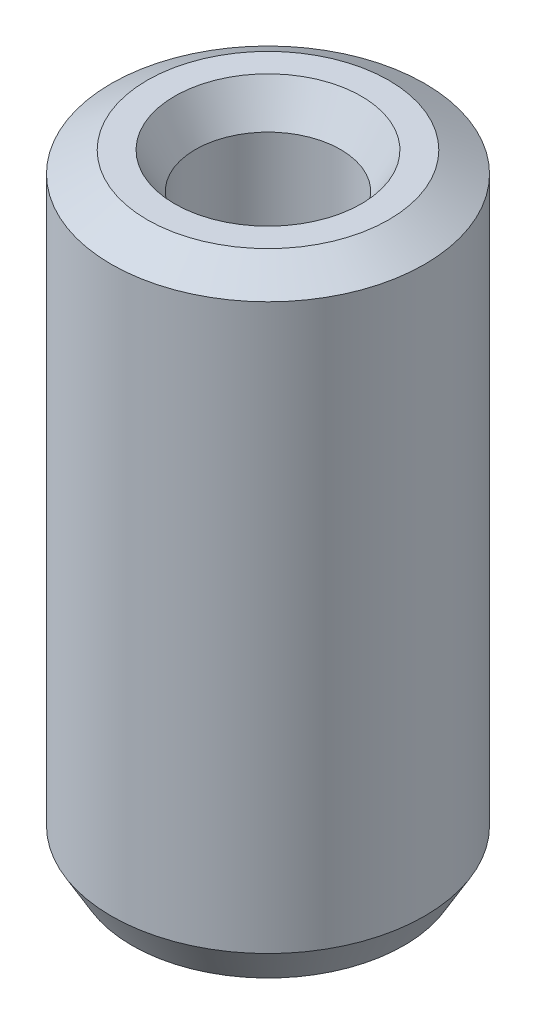
ISO-10303-21;
HEADER;
FILE_DESCRIPTION(('STEP AP214'),'2;1');
FILE_NAME('part.step','',(''),(''),'','','');
FILE_SCHEMA(('AUTOMOTIVE_DESIGN { 1 0 10303 214 1 1 1 1 }'));
ENDSEC;
DATA;
#1=APPLICATION_CONTEXT('core data for automotive mechanical design processes');
#2=APPLICATION_PROTOCOL_DEFINITION('international standard','automotive_design',2000,#1);
#3=PRODUCT_CONTEXT('',#1,'mechanical');
#4=PRODUCT('Part','Part','',(#3));
#5=PRODUCT_RELATED_PRODUCT_CATEGORY('part','',(#4));
#6=PRODUCT_DEFINITION_FORMATION('','',#4);
#7=PRODUCT_DEFINITION_CONTEXT('part definition',#1,'design');
#8=PRODUCT_DEFINITION('design','',#6,#7);
#9=PRODUCT_DEFINITION_SHAPE('','',#8);
#10=(LENGTH_UNIT() NAMED_UNIT(*) SI_UNIT(.MILLI.,.METRE.));
#11=(NAMED_UNIT(*) PLANE_ANGLE_UNIT() SI_UNIT($,.RADIAN.));
#12=(NAMED_UNIT(*) SI_UNIT($,.STERADIAN.) SOLID_ANGLE_UNIT());
#13=UNCERTAINTY_MEASURE_WITH_UNIT(LENGTH_MEASURE(1.E-05),#10,'distance_accuracy_value','');
#14=(GEOMETRIC_REPRESENTATION_CONTEXT(3) GLOBAL_UNCERTAINTY_ASSIGNED_CONTEXT((#13)) GLOBAL_UNIT_ASSIGNED_CONTEXT((#10,
#11,#12)) REPRESENTATION_CONTEXT('',''));
#15=CARTESIAN_POINT('',(0.,0.,0.));
#16=DIRECTION('',(0.,0.,1.));
#17=DIRECTION('',(1.,0.,0.));
#18=AXIS2_PLACEMENT_3D('',#15,#16,#17);
#19=CARTESIAN_POINT('',(0.,89.1913426871071,0.));
#20=DIRECTION('',(0.,-1.,0.));
#21=DIRECTION('',(0.,0.,-1.));
#22=AXIS2_PLACEMENT_3D('',#19,#20,#21);
#23=CYLINDRICAL_SURFACE('',#22,22.5);
#24=CARTESIAN_POINT('',(0.,5.14901907962285,0.));
#25=DIRECTION('',(0.,1.,0.));
#26=DIRECTION('',(0.,0.,1.));
#27=AXIS2_PLACEMENT_3D('',#24,#25,#26);
#28=CIRCLE('',#27,22.5);
#29=CARTESIAN_POINT('',(0.,5.14901907962285,-22.5));
#30=VERTEX_POINT('',#29);
#31=EDGE_CURVE('E10',#30,#30,#28,.T.);
#32=CARTESIAN_POINT('',(0.,86.2185551354244,0.));
#33=DIRECTION('',(0.,1.,0.));
#34=DIRECTION('',(0.,0.,1.));
#35=AXIS2_PLACEMENT_3D('',#32,#33,#34);
#36=CIRCLE('',#35,22.5);
#37=CARTESIAN_POINT('',(0.,86.2185551354244,-22.5));
#38=VERTEX_POINT('',#37);
#39=EDGE_CURVE('E50',#38,#38,#36,.F.);
#40=CARTESIAN_POINT('',(0.,5.14901907962285,-22.5));
#41=CARTESIAN_POINT('',(0.,5.99349341353745,-22.5));
#42=CARTESIAN_POINT('',(0.,6.83796774745205,-22.5));
#43=CARTESIAN_POINT('',(0.,8.52691641528125,-22.5));
#44=CARTESIAN_POINT('',(0.,9.37139074919585,-22.5));
#45=CARTESIAN_POINT('',(0.,11.060339417025,-22.5));
#46=CARTESIAN_POINT('',(0.,11.9048137509396,-22.5));
#47=CARTESIAN_POINT('',(0.,13.5937624187688,-22.5));
#48=CARTESIAN_POINT('',(0.,14.4382367526834,-22.5));
#49=CARTESIAN_POINT('',(0.,16.1271854205126,-22.5));
#50=CARTESIAN_POINT('',(0.,16.9716597544272,-22.5));
#51=CARTESIAN_POINT('',(0.,18.6606084222564,-22.5));
#52=CARTESIAN_POINT('',(0.,19.505082756171,-22.5));
#53=CARTESIAN_POINT('',(0.,21.1940314240002,-22.5));
#54=CARTESIAN_POINT('',(0.,22.0385057579148,-22.5));
#55=CARTESIAN_POINT('',(0.,23.727454425744,-22.5));
#56=CARTESIAN_POINT('',(0.,24.5719287596586,-22.5));
#57=CARTESIAN_POINT('',(0.,26.2608774274878,-22.5));
#58=CARTESIAN_POINT('',(0.,27.1053517614024,-22.5));
#59=CARTESIAN_POINT('',(0.,28.7943004292316,-22.5));
#60=CARTESIAN_POINT('',(0.,29.6387747631462,-22.5));
#61=CARTESIAN_POINT('',(0.,31.3277234309754,-22.5));
#62=CARTESIAN_POINT('',(0.,32.17219776489,-22.5));
#63=CARTESIAN_POINT('',(0.,33.8611464327192,-22.5));
#64=CARTESIAN_POINT('',(0.,34.7056207666338,-22.5));
#65=CARTESIAN_POINT('',(0.,36.394569434463,-22.5));
#66=CARTESIAN_POINT('',(0.,37.2390437683776,-22.5));
#67=CARTESIAN_POINT('',(0.,38.9279924362068,-22.5));
#68=CARTESIAN_POINT('',(0.,39.7724667701214,-22.5));
#69=CARTESIAN_POINT('',(0.,41.4614154379506,-22.5));
#70=CARTESIAN_POINT('',(0.,42.3058897718652,-22.5));
#71=CARTESIAN_POINT('',(0.,43.9948384396944,-22.5));
#72=CARTESIAN_POINT('',(0.,44.839312773609,-22.5));
#73=CARTESIAN_POINT('',(0.,46.5282614414382,-22.5));
#74=CARTESIAN_POINT('',(0.,47.3727357753528,-22.5));
#75=CARTESIAN_POINT('',(0.,49.061684443182,-22.5));
#76=CARTESIAN_POINT('',(0.,49.9061587770966,-22.5));
#77=CARTESIAN_POINT('',(0.,51.5951074449258,-22.5));
#78=CARTESIAN_POINT('',(0.,52.4395817788404,-22.5));
#79=CARTESIAN_POINT('',(0.,54.1285304466696,-22.5));
#80=CARTESIAN_POINT('',(0.,54.9730047805842,-22.5));
#81=CARTESIAN_POINT('',(0.,56.6619534484134,-22.5));
#82=CARTESIAN_POINT('',(0.,57.506427782328,-22.5));
#83=CARTESIAN_POINT('',(0.,59.1953764501572,-22.5));
#84=CARTESIAN_POINT('',(0.,60.0398507840718,-22.5));
#85=CARTESIAN_POINT('',(0.,61.728799451901,-22.5));
#86=CARTESIAN_POINT('',(0.,62.5732737858156,-22.5));
#87=CARTESIAN_POINT('',(0.,64.2622224536448,-22.5));
#88=CARTESIAN_POINT('',(0.,65.1066967875594,-22.5));
#89=CARTESIAN_POINT('',(0.,66.7956454553886,-22.5));
#90=CARTESIAN_POINT('',(0.,67.6401197893032,-22.5));
#91=CARTESIAN_POINT('',(0.,69.3290684571324,-22.5));
#92=CARTESIAN_POINT('',(0.,70.173542791047,-22.5));
#93=CARTESIAN_POINT('',(0.,71.8624914588762,-22.5));
#94=CARTESIAN_POINT('',(0.,72.7069657927908,-22.5));
#95=CARTESIAN_POINT('',(0.,74.39591446062,-22.5));
#96=CARTESIAN_POINT('',(0.,75.2403887945346,-22.5));
#97=CARTESIAN_POINT('',(0.,76.9293374623638,-22.5));
#98=CARTESIAN_POINT('',(0.,77.7738117962784,-22.5));
#99=CARTESIAN_POINT('',(0.,79.4627604641076,-22.5));
#100=CARTESIAN_POINT('',(0.,80.3072347980222,-22.5));
#101=CARTESIAN_POINT('',(0.,81.9961834658514,-22.5));
#102=CARTESIAN_POINT('',(0.,82.840657799766,-22.5));
#103=CARTESIAN_POINT('',(0.,84.5296064675952,-22.5));
#104=CARTESIAN_POINT('',(0.,85.3740808015098,-22.5));
#105=CARTESIAN_POINT('',(0.,86.2185551354244,-22.5));
#106=B_SPLINE_CURVE_WITH_KNOTS('',3,(#40,#41,#42,#43,#44,#45,#46,#47,#48,#49,#50,#51,#52,#53,
#54,#55,#56,#57,#58,#59,#60,#61,#62,#63,#64,#65,#66,#67,#68,#69,#70,#71,#72,#73,#74,#75,#76,#77,
#78,#79,#80,#81,#82,#83,#84,#85,#86,#87,#88,#89,#90,#91,#92,#93,#94,#95,#96,#97,#98,#99,#100,
#101,#102,#103,#104,#105),.UNSPECIFIED.,.F.,.F.,(4,2,2,2,2,2,2,2,2,2,2,2,2,2,2,2,2,2,2,2,2,2,2,
2,2,2,2,2,2,2,2,2,4),(0.,2.53342300174379,5.0668460034876,7.60026900523139,10.1336920069752,
12.667115008719,15.2005380104628,17.7339610122066,20.2673840139504,22.8008070156942,
25.334230017438,27.8676530191818,30.4010760209256,32.9344990226694,35.4679220244132,
38.0013450261569,40.5347680279008,43.0681910296446,45.6016140313883,48.1350370331321,
50.6684600348759,53.2018830366197,55.7353060383635,58.2687290401073,60.8021520418511,
63.3355750435949,65.8689980453387,68.4024210470825,70.9358440488263,73.4692670505701,
76.0026900523139,78.5361130540577,81.0695360558015),.UNSPECIFIED.);
#107=EDGE_CURVE('BSEAM39',#30,#38,#106,.T.);
#108=ORIENTED_EDGE('',*,*,#31,.T.);
#109=ORIENTED_EDGE('',*,*,#39,.T.);
#110=ORIENTED_EDGE('',*,*,#107,.T.);
#111=ORIENTED_EDGE('',*,*,#107,.F.);
#112=EDGE_LOOP('',(#108,#110,#109,#111));
#113=FACE_BOUND('',#112,.T.);
#114=ADVANCED_FACE('F39',(#113),#23,.T.);
#115=CARTESIAN_POINT('',(0.,89.1913426871071,0.));
#116=DIRECTION('',(0.,1.,0.));
#117=DIRECTION('',(0.,0.,1.));
#118=AXIS2_PLACEMENT_3D('',#115,#116,#117);
#119=PLANE('',#118);
#120=CARTESIAN_POINT('',(0.,89.1913426871071,0.));
#121=DIRECTION('',(0.,1.,0.));
#122=DIRECTION('',(0.,0.,1.));
#123=AXIS2_PLACEMENT_3D('',#120,#121,#122);
#124=CIRCLE('',#123,13.4046888107313);
#125=CARTESIAN_POINT('',(0.,89.1913426871071,13.4046888107313));
#126=VERTEX_POINT('',#125);
#127=EDGE_CURVE('E58',#126,#126,#124,.F.);
#128=ORIENTED_EDGE('',*,*,#127,.T.);
#129=EDGE_LOOP('',(#128));
#130=FACE_BOUND('',#129,.T.);
#131=CARTESIAN_POINT('',(0.,89.1913426871071,0.));
#132=DIRECTION('',(0.,1.,0.));
#133=DIRECTION('',(0.,0.,1.));
#134=AXIS2_PLACEMENT_3D('',#131,#132,#133);
#135=CIRCLE('',#134,17.3509809203773);
#136=CARTESIAN_POINT('',(0.,89.1913426871071,17.3509809203773));
#137=VERTEX_POINT('',#136);
#138=EDGE_CURVE('E61',#137,#137,#135,.T.);
#139=ORIENTED_EDGE('',*,*,#138,.T.);
#140=EDGE_LOOP('',(#139));
#141=FACE_BOUND('',#140,.T.);
#142=ADVANCED_FACE('F88',(#130,#141),#119,.T.);
#143=CARTESIAN_POINT('',(0.,0.,0.));
#144=DIRECTION('',(0.,1.,0.));
#145=DIRECTION('',(0.,0.,1.));
#146=AXIS2_PLACEMENT_3D('',#143,#144,#145);
#147=PLANE('',#146);
#148=CARTESIAN_POINT('',(0.,0.,0.));
#149=DIRECTION('',(0.,1.,0.));
#150=DIRECTION('',(0.,0.,1.));
#151=AXIS2_PLACEMENT_3D('',#148,#149,#150);
#152=CIRCLE('',#151,15.5809203386711);
#153=CARTESIAN_POINT('',(0.,0.,15.5809203386711));
#154=VERTEX_POINT('',#153);
#155=EDGE_CURVE('E51',#154,#154,#152,.T.);
#156=ORIENTED_EDGE('',*,*,#155,.T.);
#157=EDGE_LOOP('',(#156));
#158=FACE_BOUND('',#157,.T.);
#159=CARTESIAN_POINT('',(0.,0.,0.));
#160=DIRECTION('',(0.,1.,0.));
#161=DIRECTION('',(0.,0.,1.));
#162=AXIS2_PLACEMENT_3D('',#159,#160,#161);
#163=CIRCLE('',#162,19.5272124483172);
#164=CARTESIAN_POINT('',(0.,0.,19.5272124483172));
#165=VERTEX_POINT('',#164);
#166=EDGE_CURVE('E54',#165,#165,#163,.F.);
#167=ORIENTED_EDGE('',*,*,#166,.T.);
#168=EDGE_LOOP('',(#167));
#169=FACE_BOUND('',#168,.T.);
#170=ADVANCED_FACE('F83',(#158,#169),#147,.F.);
#171=CARTESIAN_POINT('',(0.,89.1913426871071,0.));
#172=DIRECTION('',(0.,-1.,0.));
#173=DIRECTION('',(0.,0.,-1.));
#174=AXIS2_PLACEMENT_3D('',#171,#172,#173);
#175=CYLINDRICAL_SURFACE('',#174,10.4319012590484);
#176=CARTESIAN_POINT('',(0.,84.0423236074842,0.));
#177=DIRECTION('',(0.,1.,0.));
#178=DIRECTION('',(0.,0.,1.));
#179=AXIS2_PLACEMENT_3D('',#176,#177,#178);
#180=CIRCLE('',#179,10.4319012590484);
#181=CARTESIAN_POINT('',(0.,84.0423236074842,-10.4319012590484));
#182=VERTEX_POINT('',#181);
#183=EDGE_CURVE('E67',#182,#182,#180,.T.);
#184=CARTESIAN_POINT('',(0.,2.97278755168272,0.));
#185=DIRECTION('',(0.,1.,0.));
#186=DIRECTION('',(0.,0.,1.));
#187=AXIS2_PLACEMENT_3D('',#184,#185,#186);
#188=CIRCLE('',#187,10.4319012590484);
#189=CARTESIAN_POINT('',(0.,2.97278755168272,-10.4319012590484));
#190=VERTEX_POINT('',#189);
#191=EDGE_CURVE('E69',#190,#190,#188,.F.);
#192=CARTESIAN_POINT('',(0.,84.0423236074842,-10.4319012590484));
#193=CARTESIAN_POINT('',(0.,83.1978492735696,-10.4319012590484));
#194=CARTESIAN_POINT('',(0.,82.353374939655,-10.4319012590484));
#195=CARTESIAN_POINT('',(0.,80.6644262718258,-10.4319012590484));
#196=CARTESIAN_POINT('',(0.,79.8199519379112,-10.4319012590484));
#197=CARTESIAN_POINT('',(0.,78.131003270082,-10.4319012590484));
#198=CARTESIAN_POINT('',(0.,77.2865289361674,-10.4319012590484));
#199=CARTESIAN_POINT('',(0.,75.5975802683382,-10.4319012590484));
#200=CARTESIAN_POINT('',(0.,74.7531059344236,-10.4319012590484));
#201=CARTESIAN_POINT('',(0.,73.0641572665944,-10.4319012590484));
#202=CARTESIAN_POINT('',(0.,72.2196829326798,-10.4319012590484));
#203=CARTESIAN_POINT('',(0.,70.5307342648506,-10.4319012590484));
#204=CARTESIAN_POINT('',(0.,69.686259930936,-10.4319012590484));
#205=CARTESIAN_POINT('',(0.,67.9973112631068,-10.4319012590484));
#206=CARTESIAN_POINT('',(0.,67.1528369291922,-10.4319012590484));
#207=CARTESIAN_POINT('',(0.,65.463888261363,-10.4319012590484));
#208=CARTESIAN_POINT('',(0.,64.6194139274484,-10.4319012590484));
#209=CARTESIAN_POINT('',(0.,62.9304652596192,-10.4319012590484));
#210=CARTESIAN_POINT('',(0.,62.0859909257046,-10.4319012590484));
#211=CARTESIAN_POINT('',(0.,60.3970422578754,-10.4319012590484));
#212=CARTESIAN_POINT('',(0.,59.5525679239608,-10.4319012590484));
#213=CARTESIAN_POINT('',(0.,57.8636192561316,-10.4319012590484));
#214=CARTESIAN_POINT('',(0.,57.0191449222171,-10.4319012590484));
#215=CARTESIAN_POINT('',(0.,55.3301962543879,-10.4319012590484));
#216=CARTESIAN_POINT('',(0.,54.4857219204733,-10.4319012590484));
#217=CARTESIAN_POINT('',(0.,52.7967732526441,-10.4319012590484));
#218=CARTESIAN_POINT('',(0.,51.9522989187295,-10.4319012590484));
#219=CARTESIAN_POINT('',(0.,50.2633502509003,-10.4319012590484));
#220=CARTESIAN_POINT('',(0.,49.4188759169857,-10.4319012590484));
#221=CARTESIAN_POINT('',(0.,47.7299272491565,-10.4319012590484));
#222=CARTESIAN_POINT('',(0.,46.8854529152419,-10.4319012590484));
#223=CARTESIAN_POINT('',(0.,45.1965042474127,-10.4319012590484));
#224=CARTESIAN_POINT('',(0.,44.3520299134981,-10.4319012590484));
#225=CARTESIAN_POINT('',(0.,42.6630812456689,-10.4319012590484));
#226=CARTESIAN_POINT('',(0.,41.8186069117543,-10.4319012590484));
#227=CARTESIAN_POINT('',(0.,40.1296582439251,-10.4319012590484));
#228=CARTESIAN_POINT('',(0.,39.2851839100105,-10.4319012590484));
#229=CARTESIAN_POINT('',(0.,37.5962352421813,-10.4319012590484));
#230=CARTESIAN_POINT('',(0.,36.7517609082667,-10.4319012590484));
#231=CARTESIAN_POINT('',(0.,35.0628122404375,-10.4319012590484));
#232=CARTESIAN_POINT('',(0.,34.2183379065229,-10.4319012590484));
#233=CARTESIAN_POINT('',(0.,32.5293892386937,-10.4319012590484));
#234=CARTESIAN_POINT('',(0.,31.6849149047791,-10.4319012590484));
#235=CARTESIAN_POINT('',(0.,29.9959662369499,-10.4319012590484));
#236=CARTESIAN_POINT('',(0.,29.1514919030353,-10.4319012590484));
#237=CARTESIAN_POINT('',(0.,27.4625432352061,-10.4319012590484));
#238=CARTESIAN_POINT('',(0.,26.6180689012915,-10.4319012590484));
#239=CARTESIAN_POINT('',(0.,24.9291202334623,-10.4319012590484));
#240=CARTESIAN_POINT('',(0.,24.0846458995477,-10.4319012590484));
#241=CARTESIAN_POINT('',(0.,22.3956972317185,-10.4319012590484));
#242=CARTESIAN_POINT('',(0.,21.5512228978039,-10.4319012590484));
#243=CARTESIAN_POINT('',(0.,19.8622742299747,-10.4319012590484));
#244=CARTESIAN_POINT('',(0.,19.0177998960601,-10.4319012590484));
#245=CARTESIAN_POINT('',(0.,17.3288512282309,-10.4319012590484));
#246=CARTESIAN_POINT('',(0.,16.4843768943163,-10.4319012590484));
#247=CARTESIAN_POINT('',(0.,14.7954282264871,-10.4319012590484));
#248=CARTESIAN_POINT('',(0.,13.9509538925725,-10.4319012590484));
#249=CARTESIAN_POINT('',(0.,12.2620052247433,-10.4319012590484));
#250=CARTESIAN_POINT('',(0.,11.4175308908287,-10.4319012590484));
#251=CARTESIAN_POINT('',(0.,9.72858222299952,-10.4319012590484));
#252=CARTESIAN_POINT('',(0.,8.88410788908492,-10.4319012590484));
#253=CARTESIAN_POINT('',(0.,7.19515922125573,-10.4319012590484));
#254=CARTESIAN_POINT('',(0.,6.35068488734113,-10.4319012590484));
#255=CARTESIAN_POINT('',(0.,4.66173621951192,-10.4319012590484));
#256=CARTESIAN_POINT('',(0.,3.81726188559732,-10.4319012590484));
#257=CARTESIAN_POINT('',(0.,2.97278755168272,-10.4319012590484));
#258=B_SPLINE_CURVE_WITH_KNOTS('',3,(#192,#193,#194,#195,#196,#197,#198,#199,#200,#201,#202,
#203,#204,#205,#206,#207,#208,#209,#210,#211,#212,#213,#214,#215,#216,#217,#218,#219,#220,#221,
#222,#223,#224,#225,#226,#227,#228,#229,#230,#231,#232,#233,#234,#235,#236,#237,#238,#239,#240,
#241,#242,#243,#244,#245,#246,#247,#248,#249,#250,#251,#252,#253,#254,#255,#256,#257),
.UNSPECIFIED.,.F.,.F.,(4,2,2,2,2,2,2,2,2,2,2,2,2,2,2,2,2,2,2,2,2,2,2,2,2,2,2,2,2,2,2,2,4),(0.,
2.53342300174381,5.0668460034876,7.60026900523139,10.1336920069752,12.667115008719,
15.2005380104628,17.7339610122066,20.2673840139504,22.8008070156942,25.334230017438,
27.8676530191818,30.4010760209256,32.9344990226694,35.4679220244132,38.0013450261569,
40.5347680279008,43.0681910296446,45.6016140313883,48.1350370331321,50.6684600348759,
53.2018830366197,55.7353060383635,58.2687290401073,60.8021520418511,63.3355750435949,
65.8689980453387,68.4024210470825,70.9358440488263,73.4692670505701,76.0026900523139,
78.5361130540577,81.0695360558015),.UNSPECIFIED.);
#259=EDGE_CURVE('BSEAM71',#182,#190,#258,.T.);
#260=ORIENTED_EDGE('',*,*,#183,.T.);
#261=ORIENTED_EDGE('',*,*,#191,.T.);
#262=ORIENTED_EDGE('',*,*,#259,.T.);
#263=ORIENTED_EDGE('',*,*,#259,.F.);
#264=EDGE_LOOP('',(#260,#262,#261,#263));
#265=FACE_BOUND('',#264,.T.);
#266=ADVANCED_FACE('F71',(#265),#175,.F.);
#267=CARTESIAN_POINT('',(0.,84.0423236074842,0.));
#268=DIRECTION('',(0.,1.,0.));
#269=DIRECTION('',(0.,0.,1.));
#270=AXIS2_PLACEMENT_3D('',#267,#268,#269);
#271=CONICAL_SURFACE('',#270,10.4319012590484,0.523598775598303);
#272=ORIENTED_EDGE('',*,*,#127,.F.);
#273=EDGE_LOOP('',(#272));
#274=FACE_BOUND('',#273,.T.);
#275=ORIENTED_EDGE('',*,*,#183,.F.);
#276=EDGE_LOOP('',(#275));
#277=FACE_BOUND('',#276,.T.);
#278=ADVANCED_FACE('F77',(#274,#277),#271,.F.);
#279=CARTESIAN_POINT('',(0.,0.,0.));
#280=DIRECTION('',(0.,-1.,0.));
#281=DIRECTION('',(0.,0.,-1.));
#282=AXIS2_PLACEMENT_3D('',#279,#280,#281);
#283=CONICAL_SURFACE('',#282,15.5809203386711,1.04719755119659);
#284=ORIENTED_EDGE('',*,*,#191,.F.);
#285=EDGE_LOOP('',(#284));
#286=FACE_BOUND('',#285,.T.);
#287=ORIENTED_EDGE('',*,*,#155,.F.);
#288=EDGE_LOOP('',(#287));
#289=FACE_BOUND('',#288,.T.);
#290=ADVANCED_FACE('F73',(#286,#289),#283,.F.);
#291=CARTESIAN_POINT('',(0.,5.14901907962285,0.));
#292=DIRECTION('',(0.,1.,0.));
#293=DIRECTION('',(0.,0.,1.));
#294=AXIS2_PLACEMENT_3D('',#291,#292,#293);
#295=CONICAL_SURFACE('',#294,22.5,0.523598775598303);
#296=ORIENTED_EDGE('',*,*,#166,.F.);
#297=EDGE_LOOP('',(#296));
#298=FACE_BOUND('',#297,.T.);
#299=ORIENTED_EDGE('',*,*,#31,.F.);
#300=EDGE_LOOP('',(#299));
#301=FACE_BOUND('',#300,.T.);
#302=ADVANCED_FACE('F76',(#298,#301),#295,.T.);
#303=CARTESIAN_POINT('',(0.,89.1913426871071,0.));
#304=DIRECTION('',(0.,-1.,0.));
#305=DIRECTION('',(0.,0.,-1.));
#306=AXIS2_PLACEMENT_3D('',#303,#304,#305);
#307=CONICAL_SURFACE('',#306,17.3509809203773,1.04719755119659);
#308=ORIENTED_EDGE('',*,*,#39,.F.);
#309=EDGE_LOOP('',(#308));
#310=FACE_BOUND('',#309,.T.);
#311=ORIENTED_EDGE('',*,*,#138,.F.);
#312=EDGE_LOOP('',(#311));
#313=FACE_BOUND('',#312,.T.);
#314=ADVANCED_FACE('F45',(#310,#313),#307,.T.);
#315=CLOSED_SHELL('',(#114,#142,#170,#266,#278,#290,#302,#314));
#316=MANIFOLD_SOLID_BREP('B2',#315);
#317=ADVANCED_BREP_SHAPE_REPRESENTATION('',(#18,#316),#14);
#318=SHAPE_DEFINITION_REPRESENTATION(#9,#317);
ENDSEC;
END-ISO-10303-21;
